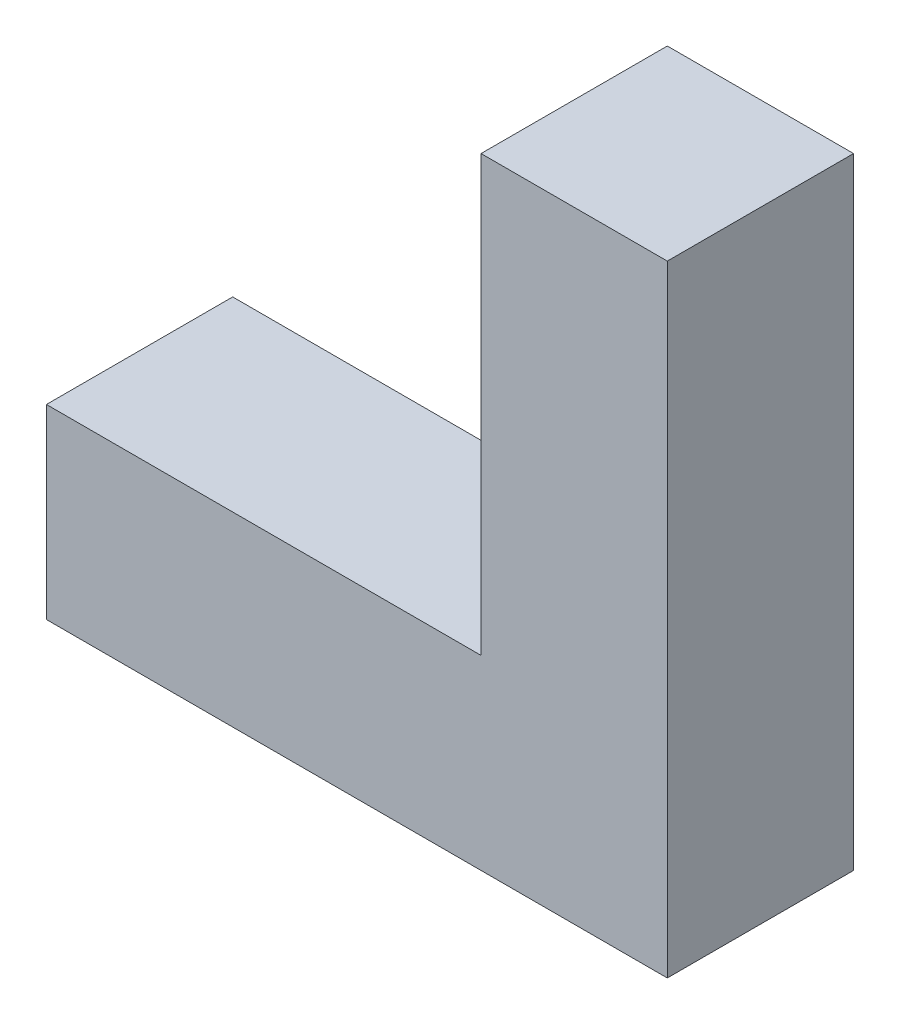
ISO-10303-21;
HEADER;
FILE_DESCRIPTION(('STEP AP214'),'2;1');
FILE_NAME('part.step','',(''),(''),'','','');
FILE_SCHEMA(('AUTOMOTIVE_DESIGN { 1 0 10303 214 1 1 1 1 }'));
ENDSEC;
DATA;
#1=APPLICATION_CONTEXT('core data for automotive mechanical design processes');
#2=APPLICATION_PROTOCOL_DEFINITION('international standard','automotive_design',2000,#1);
#3=PRODUCT_CONTEXT('',#1,'mechanical');
#4=PRODUCT('Part','Part','',(#3));
#5=PRODUCT_RELATED_PRODUCT_CATEGORY('part','',(#4));
#6=PRODUCT_DEFINITION_FORMATION('','',#4);
#7=PRODUCT_DEFINITION_CONTEXT('part definition',#1,'design');
#8=PRODUCT_DEFINITION('design','',#6,#7);
#9=PRODUCT_DEFINITION_SHAPE('','',#8);
#10=(LENGTH_UNIT() NAMED_UNIT(*) SI_UNIT(.MILLI.,.METRE.));
#11=(NAMED_UNIT(*) PLANE_ANGLE_UNIT() SI_UNIT($,.RADIAN.));
#12=(NAMED_UNIT(*) SI_UNIT($,.STERADIAN.) SOLID_ANGLE_UNIT());
#13=UNCERTAINTY_MEASURE_WITH_UNIT(LENGTH_MEASURE(1.E-05),#10,'distance_accuracy_value','');
#14=(GEOMETRIC_REPRESENTATION_CONTEXT(3) GLOBAL_UNCERTAINTY_ASSIGNED_CONTEXT((#13)) GLOBAL_UNIT_ASSIGNED_CONTEXT((#10,
#11,#12)) REPRESENTATION_CONTEXT('',''));
#15=CARTESIAN_POINT('',(0.,0.,0.));
#16=DIRECTION('',(0.,0.,1.));
#17=DIRECTION('',(1.,0.,0.));
#18=AXIS2_PLACEMENT_3D('',#15,#16,#17);
#19=CARTESIAN_POINT('',(0.,140.,60.));
#20=DIRECTION('',(1.,0.,0.));
#21=DIRECTION('',(0.,1.,0.));
#22=AXIS2_PLACEMENT_3D('',#19,#20,#21);
#23=PLANE('',#22);
#24=DIRECTION('',(0.,-1.,0.));
#25=VECTOR('',#24,1.);
#26=CARTESIAN_POINT('',(0.,140.,0.));
#27=LINE('',#26,#25);
#28=CARTESIAN_POINT('',(0.,140.,0.));
#29=VERTEX_POINT('',#28);
#30=CARTESIAN_POINT('',(0.,0.,0.));
#31=VERTEX_POINT('',#30);
#32=EDGE_CURVE('E117',#29,#31,#27,.T.);
#33=ORIENTED_EDGE('',*,*,#32,.T.);
#34=DIRECTION('',(0.,0.,-1.));
#35=VECTOR('',#34,1.);
#36=CARTESIAN_POINT('',(0.,0.,60.));
#37=LINE('',#36,#35);
#38=CARTESIAN_POINT('',(0.,0.,60.));
#39=VERTEX_POINT('',#38);
#40=EDGE_CURVE('E11',#39,#31,#37,.T.);
#41=ORIENTED_EDGE('',*,*,#40,.F.);
#42=DIRECTION('',(0.,-1.,0.));
#43=VECTOR('',#42,1.);
#44=CARTESIAN_POINT('',(0.,140.,60.));
#45=LINE('',#44,#43);
#46=CARTESIAN_POINT('',(0.,140.,60.));
#47=VERTEX_POINT('',#46);
#48=EDGE_CURVE('E127',#47,#39,#45,.T.);
#49=ORIENTED_EDGE('',*,*,#48,.F.);
#50=DIRECTION('',(0.,0.,-1.));
#51=VECTOR('',#50,1.);
#52=CARTESIAN_POINT('',(0.,140.,60.));
#53=LINE('',#52,#51);
#54=EDGE_CURVE('E113',#47,#29,#53,.T.);
#55=ORIENTED_EDGE('',*,*,#54,.T.);
#56=EDGE_LOOP('',(#33,#41,#49,#55));
#57=FACE_BOUND('',#56,.T.);
#58=ADVANCED_FACE('F33',(#57),#23,.F.);
#59=CARTESIAN_POINT('',(0.,0.,60.));
#60=DIRECTION('',(0.,-1.,0.));
#61=DIRECTION('',(1.,0.,0.));
#62=AXIS2_PLACEMENT_3D('',#59,#60,#61);
#63=PLANE('',#62);
#64=DIRECTION('',(-1.,0.,0.));
#65=VECTOR('',#64,1.);
#66=CARTESIAN_POINT('',(0.,0.,0.));
#67=LINE('',#66,#65);
#68=CARTESIAN_POINT('',(-140.,0.,0.));
#69=VERTEX_POINT('',#68);
#70=EDGE_CURVE('E120',#31,#69,#67,.T.);
#71=ORIENTED_EDGE('',*,*,#70,.T.);
#72=DIRECTION('',(0.,0.,-1.));
#73=VECTOR('',#72,1.);
#74=CARTESIAN_POINT('',(-140.,0.,60.));
#75=LINE('',#74,#73);
#76=CARTESIAN_POINT('',(-140.,0.,60.));
#77=VERTEX_POINT('',#76);
#78=EDGE_CURVE('E41',#77,#69,#75,.T.);
#79=ORIENTED_EDGE('',*,*,#78,.F.);
#80=DIRECTION('',(-1.,0.,0.));
#81=VECTOR('',#80,1.);
#82=CARTESIAN_POINT('',(0.,0.,60.));
#83=LINE('',#82,#81);
#84=EDGE_CURVE('E86',#39,#77,#83,.T.);
#85=ORIENTED_EDGE('',*,*,#84,.F.);
#86=ORIENTED_EDGE('',*,*,#40,.T.);
#87=EDGE_LOOP('',(#71,#79,#85,#86));
#88=FACE_BOUND('',#87,.T.);
#89=ADVANCED_FACE('F151',(#88),#63,.F.);
#90=CARTESIAN_POINT('',(-140.,0.,60.));
#91=DIRECTION('',(1.,0.,0.));
#92=DIRECTION('',(0.,0.,-1.));
#93=AXIS2_PLACEMENT_3D('',#90,#91,#92);
#94=PLANE('',#93);
#95=DIRECTION('',(0.,-1.,0.));
#96=VECTOR('',#95,1.);
#97=CARTESIAN_POINT('',(-140.,0.,0.));
#98=LINE('',#97,#96);
#99=CARTESIAN_POINT('',(-140.,-60.,0.));
#100=VERTEX_POINT('',#99);
#101=EDGE_CURVE('E122',#69,#100,#98,.T.);
#102=ORIENTED_EDGE('',*,*,#101,.T.);
#103=DIRECTION('',(0.,0.,-1.));
#104=VECTOR('',#103,1.);
#105=CARTESIAN_POINT('',(-140.,-60.,60.));
#106=LINE('',#105,#104);
#107=CARTESIAN_POINT('',(-140.,-60.,60.));
#108=VERTEX_POINT('',#107);
#109=EDGE_CURVE('E108',#108,#100,#106,.T.);
#110=ORIENTED_EDGE('',*,*,#109,.F.);
#111=DIRECTION('',(0.,-1.,0.));
#112=VECTOR('',#111,1.);
#113=CARTESIAN_POINT('',(-140.,0.,60.));
#114=LINE('',#113,#112);
#115=EDGE_CURVE('E99',#77,#108,#114,.T.);
#116=ORIENTED_EDGE('',*,*,#115,.F.);
#117=ORIENTED_EDGE('',*,*,#78,.T.);
#118=EDGE_LOOP('',(#102,#110,#116,#117));
#119=FACE_BOUND('',#118,.T.);
#120=ADVANCED_FACE('F133',(#119),#94,.F.);
#121=CARTESIAN_POINT('',(-140.,-60.,60.));
#122=DIRECTION('',(0.,1.,0.));
#123=DIRECTION('',(0.,0.,1.));
#124=AXIS2_PLACEMENT_3D('',#121,#122,#123);
#125=PLANE('',#124);
#126=DIRECTION('',(1.,0.,0.));
#127=VECTOR('',#126,1.);
#128=CARTESIAN_POINT('',(-140.,-60.,0.));
#129=LINE('',#128,#127);
#130=CARTESIAN_POINT('',(60.,-60.,0.));
#131=VERTEX_POINT('',#130);
#132=EDGE_CURVE('E107',#100,#131,#129,.T.);
#133=ORIENTED_EDGE('',*,*,#132,.T.);
#134=DIRECTION('',(0.,0.,-1.));
#135=VECTOR('',#134,1.);
#136=CARTESIAN_POINT('',(60.,-60.,60.));
#137=LINE('',#136,#135);
#138=CARTESIAN_POINT('',(60.,-60.,60.));
#139=VERTEX_POINT('',#138);
#140=EDGE_CURVE('E104',#139,#131,#137,.T.);
#141=ORIENTED_EDGE('',*,*,#140,.F.);
#142=DIRECTION('',(1.,0.,0.));
#143=VECTOR('',#142,1.);
#144=CARTESIAN_POINT('',(-140.,-60.,60.));
#145=LINE('',#144,#143);
#146=EDGE_CURVE('E93',#108,#139,#145,.T.);
#147=ORIENTED_EDGE('',*,*,#146,.F.);
#148=ORIENTED_EDGE('',*,*,#109,.T.);
#149=EDGE_LOOP('',(#133,#141,#147,#148));
#150=FACE_BOUND('',#149,.T.);
#151=ADVANCED_FACE('F105',(#150),#125,.F.);
#152=CARTESIAN_POINT('',(60.,-60.,60.));
#153=DIRECTION('',(-1.,0.,0.));
#154=DIRECTION('',(0.,0.,1.));
#155=AXIS2_PLACEMENT_3D('',#152,#153,#154);
#156=PLANE('',#155);
#157=DIRECTION('',(0.,1.,0.));
#158=VECTOR('',#157,1.);
#159=CARTESIAN_POINT('',(60.,-60.,0.));
#160=LINE('',#159,#158);
#161=CARTESIAN_POINT('',(60.,140.,0.));
#162=VERTEX_POINT('',#161);
#163=EDGE_CURVE('E72',#131,#162,#160,.T.);
#164=ORIENTED_EDGE('',*,*,#163,.T.);
#165=DIRECTION('',(0.,0.,-1.));
#166=VECTOR('',#165,1.);
#167=CARTESIAN_POINT('',(60.,140.,60.));
#168=LINE('',#167,#166);
#169=CARTESIAN_POINT('',(60.,140.,60.));
#170=VERTEX_POINT('',#169);
#171=EDGE_CURVE('E109',#170,#162,#168,.T.);
#172=ORIENTED_EDGE('',*,*,#171,.F.);
#173=DIRECTION('',(0.,1.,0.));
#174=VECTOR('',#173,1.);
#175=CARTESIAN_POINT('',(60.,-60.,60.));
#176=LINE('',#175,#174);
#177=EDGE_CURVE('E97',#139,#170,#176,.T.);
#178=ORIENTED_EDGE('',*,*,#177,.F.);
#179=ORIENTED_EDGE('',*,*,#140,.T.);
#180=EDGE_LOOP('',(#164,#172,#178,#179));
#181=FACE_BOUND('',#180,.T.);
#182=ADVANCED_FACE('F111',(#181),#156,.F.);
#183=CARTESIAN_POINT('',(60.,140.,60.));
#184=DIRECTION('',(0.,-1.,0.));
#185=DIRECTION('',(0.,0.,-1.));
#186=AXIS2_PLACEMENT_3D('',#183,#184,#185);
#187=PLANE('',#186);
#188=DIRECTION('',(-1.,0.,0.));
#189=VECTOR('',#188,1.);
#190=CARTESIAN_POINT('',(60.,140.,0.));
#191=LINE('',#190,#189);
#192=EDGE_CURVE('E78',#162,#29,#191,.T.);
#193=ORIENTED_EDGE('',*,*,#192,.T.);
#194=ORIENTED_EDGE('',*,*,#54,.F.);
#195=DIRECTION('',(-1.,0.,0.));
#196=VECTOR('',#195,1.);
#197=CARTESIAN_POINT('',(60.,140.,60.));
#198=LINE('',#197,#196);
#199=EDGE_CURVE('E49',#170,#47,#198,.T.);
#200=ORIENTED_EDGE('',*,*,#199,.F.);
#201=ORIENTED_EDGE('',*,*,#171,.T.);
#202=EDGE_LOOP('',(#193,#194,#200,#201));
#203=FACE_BOUND('',#202,.T.);
#204=ADVANCED_FACE('F140',(#203),#187,.F.);
#205=CARTESIAN_POINT('',(0.,0.,60.));
#206=DIRECTION('',(0.,0.,-1.));
#207=DIRECTION('',(-1.,0.,0.));
#208=AXIS2_PLACEMENT_3D('',#205,#206,#207);
#209=PLANE('',#208);
#210=ORIENTED_EDGE('',*,*,#48,.T.);
#211=ORIENTED_EDGE('',*,*,#84,.T.);
#212=ORIENTED_EDGE('',*,*,#115,.T.);
#213=ORIENTED_EDGE('',*,*,#146,.T.);
#214=ORIENTED_EDGE('',*,*,#177,.T.);
#215=ORIENTED_EDGE('',*,*,#199,.T.);
#216=EDGE_LOOP('',(#210,#211,#212,#213,#214,#215));
#217=FACE_BOUND('',#216,.T.);
#218=ADVANCED_FACE('F95',(#217),#209,.F.);
#219=CARTESIAN_POINT('',(0.,0.,0.));
#220=DIRECTION('',(0.,0.,-1.));
#221=DIRECTION('',(-1.,0.,0.));
#222=AXIS2_PLACEMENT_3D('',#219,#220,#221);
#223=PLANE('',#222);
#224=ORIENTED_EDGE('',*,*,#32,.F.);
#225=ORIENTED_EDGE('',*,*,#192,.F.);
#226=ORIENTED_EDGE('',*,*,#163,.F.);
#227=ORIENTED_EDGE('',*,*,#132,.F.);
#228=ORIENTED_EDGE('',*,*,#101,.F.);
#229=ORIENTED_EDGE('',*,*,#70,.F.);
#230=EDGE_LOOP('',(#224,#225,#226,#227,#228,#229));
#231=FACE_BOUND('',#230,.T.);
#232=ADVANCED_FACE('F136',(#231),#223,.T.);
#233=CLOSED_SHELL('',(#58,#89,#120,#151,#182,#204,#218,#232));
#234=MANIFOLD_SOLID_BREP('B2',#233);
#235=ADVANCED_BREP_SHAPE_REPRESENTATION('',(#18,#234),#14);
#236=SHAPE_DEFINITION_REPRESENTATION(#9,#235);
ENDSEC;
END-ISO-10303-21;
